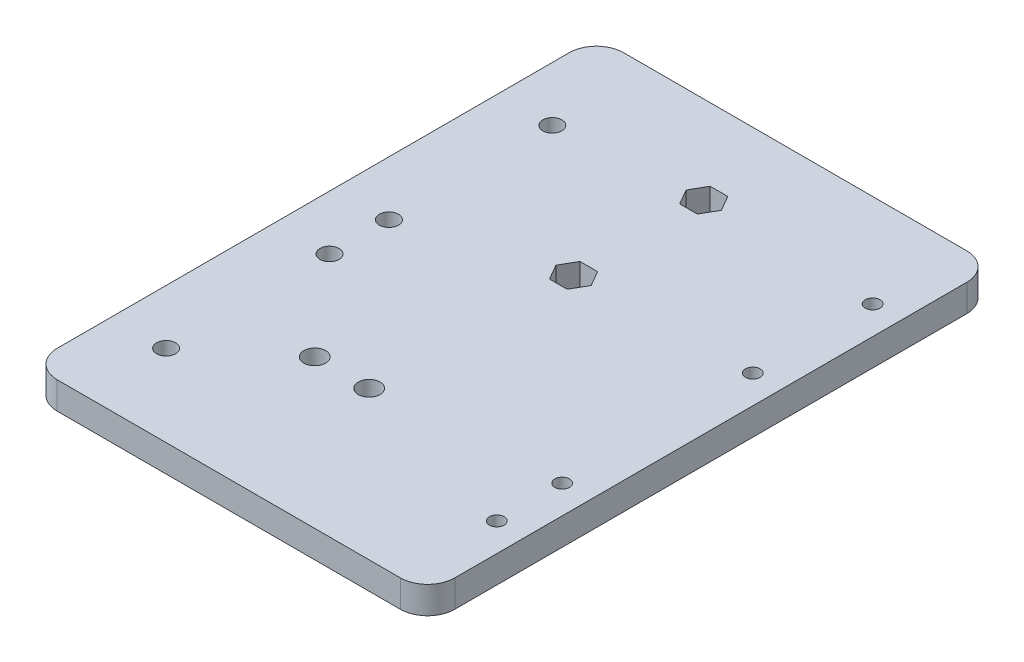
ISO-10303-21;
HEADER;
FILE_DESCRIPTION(('STEP AP214'),'2;1');
FILE_NAME('part.step','',(''),(''),'','','');
FILE_SCHEMA(('AUTOMOTIVE_DESIGN { 1 0 10303 214 1 1 1 1 }'));
ENDSEC;
DATA;
#1=APPLICATION_CONTEXT('core data for automotive mechanical design processes');
#2=APPLICATION_PROTOCOL_DEFINITION('international standard','automotive_design',2000,#1);
#3=PRODUCT_CONTEXT('',#1,'mechanical');
#4=PRODUCT('Part','Part','',(#3));
#5=PRODUCT_RELATED_PRODUCT_CATEGORY('part','',(#4));
#6=PRODUCT_DEFINITION_FORMATION('','',#4);
#7=PRODUCT_DEFINITION_CONTEXT('part definition',#1,'design');
#8=PRODUCT_DEFINITION('design','',#6,#7);
#9=PRODUCT_DEFINITION_SHAPE('','',#8);
#10=(LENGTH_UNIT() NAMED_UNIT(*) SI_UNIT(.MILLI.,.METRE.));
#11=(NAMED_UNIT(*) PLANE_ANGLE_UNIT() SI_UNIT($,.RADIAN.));
#12=(NAMED_UNIT(*) SI_UNIT($,.STERADIAN.) SOLID_ANGLE_UNIT());
#13=UNCERTAINTY_MEASURE_WITH_UNIT(LENGTH_MEASURE(1.E-05),#10,'distance_accuracy_value','');
#14=(GEOMETRIC_REPRESENTATION_CONTEXT(3) GLOBAL_UNCERTAINTY_ASSIGNED_CONTEXT((#13)) GLOBAL_UNIT_ASSIGNED_CONTEXT((#10,
#11,#12)) REPRESENTATION_CONTEXT('',''));
#15=CARTESIAN_POINT('',(0.,0.,0.));
#16=DIRECTION('',(0.,0.,1.));
#17=DIRECTION('',(1.,0.,0.));
#18=AXIS2_PLACEMENT_3D('',#15,#16,#17);
#19=CARTESIAN_POINT('',(-157.389030179501,188.784554556095,-475.424398782479));
#20=DIRECTION('',(0.,0.,-1.));
#21=DIRECTION('',(-1.,0.,0.));
#22=AXIS2_PLACEMENT_3D('',#19,#20,#21);
#23=PLANE('',#22);
#24=DIRECTION('',(1.,0.,0.));
#25=VECTOR('',#24,1.);
#26=CARTESIAN_POINT('',(-157.389030179501,188.784554556095,-475.424398782479));
#27=LINE('',#26,#25);
#28=CARTESIAN_POINT('',(-150.389030179501,188.784554556095,-475.424398782479));
#29=VERTEX_POINT('',#28);
#30=CARTESIAN_POINT('',(-87.3890301795011,188.784554556095,-475.424398782479));
#31=VERTEX_POINT('',#30);
#32=EDGE_CURVE('E302',#29,#31,#27,.T.);
#33=ORIENTED_EDGE('',*,*,#32,.F.);
#34=DIRECTION('',(0.,-1.,0.));
#35=VECTOR('',#34,1.);
#36=CARTESIAN_POINT('',(-150.389030179501,188.784554556095,-475.424398782479));
#37=LINE('',#36,#35);
#38=CARTESIAN_POINT('',(-150.389030179501,183.784554556095,-475.424398782479));
#39=VERTEX_POINT('',#38);
#40=EDGE_CURVE('E11',#29,#39,#37,.T.);
#41=ORIENTED_EDGE('',*,*,#40,.T.);
#42=DIRECTION('',(1.,0.,0.));
#43=VECTOR('',#42,1.);
#44=CARTESIAN_POINT('',(-157.389030179501,183.784554556095,-475.424398782479));
#45=LINE('',#44,#43);
#46=CARTESIAN_POINT('',(-87.3890301795011,183.784554556095,-475.424398782479));
#47=VERTEX_POINT('',#46);
#48=EDGE_CURVE('E281',#39,#47,#45,.T.);
#49=ORIENTED_EDGE('',*,*,#48,.T.);
#50=DIRECTION('',(0.,-1.,0.));
#51=VECTOR('',#50,1.);
#52=CARTESIAN_POINT('',(-87.3890301795011,188.784554556095,-475.424398782479));
#53=LINE('',#52,#51);
#54=EDGE_CURVE('E45',#47,#31,#53,.F.);
#55=ORIENTED_EDGE('',*,*,#54,.T.);
#56=EDGE_LOOP('',(#33,#41,#49,#55));
#57=FACE_BOUND('',#56,.T.);
#58=ADVANCED_FACE('F37',(#57),#23,.F.);
#59=CARTESIAN_POINT('',(-82.3890301795011,188.784554556095,-475.424398782479));
#60=DIRECTION('',(-1.,0.,0.));
#61=DIRECTION('',(0.,0.,1.));
#62=AXIS2_PLACEMENT_3D('',#59,#60,#61);
#63=PLANE('',#62);
#64=DIRECTION('',(0.,0.,-1.));
#65=VECTOR('',#64,1.);
#66=CARTESIAN_POINT('',(-82.3890301795011,183.784554556095,-475.424398782479));
#67=LINE('',#66,#65);
#68=CARTESIAN_POINT('',(-82.3890301795011,183.784554556095,-480.424398782479));
#69=VERTEX_POINT('',#68);
#70=CARTESIAN_POINT('',(-82.3890301795011,183.784554556095,-574.424398782479));
#71=VERTEX_POINT('',#70);
#72=EDGE_CURVE('E313',#69,#71,#67,.T.);
#73=ORIENTED_EDGE('',*,*,#72,.T.);
#74=DIRECTION('',(0.,-1.,0.));
#75=VECTOR('',#74,1.);
#76=CARTESIAN_POINT('',(-82.3890301795011,188.784554556095,-574.424398782479));
#77=LINE('',#76,#75);
#78=CARTESIAN_POINT('',(-82.3890301795011,188.784554556095,-574.424398782479));
#79=VERTEX_POINT('',#78);
#80=EDGE_CURVE('E333',#71,#79,#77,.F.);
#81=ORIENTED_EDGE('',*,*,#80,.T.);
#82=DIRECTION('',(0.,0.,-1.));
#83=VECTOR('',#82,1.);
#84=CARTESIAN_POINT('',(-82.3890301795011,188.784554556095,-475.424398782479));
#85=LINE('',#84,#83);
#86=CARTESIAN_POINT('',(-82.3890301795011,188.784554556095,-480.424398782479));
#87=VERTEX_POINT('',#86);
#88=EDGE_CURVE('E304',#87,#79,#85,.T.);
#89=ORIENTED_EDGE('',*,*,#88,.F.);
#90=DIRECTION('',(0.,-1.,0.));
#91=VECTOR('',#90,1.);
#92=CARTESIAN_POINT('',(-82.3890301795011,188.784554556095,-480.424398782479));
#93=LINE('',#92,#91);
#94=EDGE_CURVE('E330',#87,#69,#93,.T.);
#95=ORIENTED_EDGE('',*,*,#94,.T.);
#96=EDGE_LOOP('',(#73,#81,#89,#95));
#97=FACE_BOUND('',#96,.T.);
#98=ADVANCED_FACE('F430',(#97),#63,.F.);
#99=CARTESIAN_POINT('',(-157.389030179501,188.784554556095,-579.424398782479));
#100=DIRECTION('',(0.,0.,1.));
#101=DIRECTION('',(1.,0.,0.));
#102=AXIS2_PLACEMENT_3D('',#99,#100,#101);
#103=PLANE('',#102);
#104=DIRECTION('',(-1.,0.,0.));
#105=VECTOR('',#104,1.);
#106=CARTESIAN_POINT('',(-157.389030179501,188.784554556095,-579.424398782479));
#107=LINE('',#106,#105);
#108=CARTESIAN_POINT('',(-87.3890301795011,188.784554556095,-579.424398782479));
#109=VERTEX_POINT('',#108);
#110=CARTESIAN_POINT('',(-150.389030179501,188.784554556095,-579.424398782479));
#111=VERTEX_POINT('',#110);
#112=EDGE_CURVE('E308',#109,#111,#107,.T.);
#113=ORIENTED_EDGE('',*,*,#112,.F.);
#114=DIRECTION('',(0.,-1.,0.));
#115=VECTOR('',#114,1.);
#116=CARTESIAN_POINT('',(-87.3890301795011,188.784554556095,-579.424398782479));
#117=LINE('',#116,#115);
#118=CARTESIAN_POINT('',(-87.3890301795011,183.784554556095,-579.424398782479));
#119=VERTEX_POINT('',#118);
#120=EDGE_CURVE('E319',#109,#119,#117,.T.);
#121=ORIENTED_EDGE('',*,*,#120,.T.);
#122=DIRECTION('',(-1.,0.,0.));
#123=VECTOR('',#122,1.);
#124=CARTESIAN_POINT('',(-157.389030179501,183.784554556095,-579.424398782479));
#125=LINE('',#124,#123);
#126=CARTESIAN_POINT('',(-150.389030179501,183.784554556095,-579.424398782479));
#127=VERTEX_POINT('',#126);
#128=EDGE_CURVE('E305',#119,#127,#125,.T.);
#129=ORIENTED_EDGE('',*,*,#128,.T.);
#130=DIRECTION('',(0.,-1.,0.));
#131=VECTOR('',#130,1.);
#132=CARTESIAN_POINT('',(-150.389030179501,188.784554556095,-579.424398782479));
#133=LINE('',#132,#131);
#134=EDGE_CURVE('E311',#127,#111,#133,.F.);
#135=ORIENTED_EDGE('',*,*,#134,.T.);
#136=EDGE_LOOP('',(#113,#121,#129,#135));
#137=FACE_BOUND('',#136,.T.);
#138=ADVANCED_FACE('F435',(#137),#103,.F.);
#139=CARTESIAN_POINT('',(0.,188.784554556095,0.));
#140=DIRECTION('',(0.,-1.,0.));
#141=DIRECTION('',(0.,0.,-1.));
#142=AXIS2_PLACEMENT_3D('',#139,#140,#141);
#143=PLANE('',#142);
#144=CARTESIAN_POINT('',(-87.5890301795012,188.784554556095,-540.330584131833));
#145=DIRECTION('',(0.,-1.,0.));
#146=DIRECTION('',(0.,0.,-1.));
#147=AXIS2_PLACEMENT_3D('',#144,#145,#146);
#148=CIRCLE('',#147,1.35);
#149=CARTESIAN_POINT('',(-87.5890301795012,188.784554556095,-541.680584131833));
#150=VERTEX_POINT('',#149);
#151=EDGE_CURVE('E374',#150,#150,#148,.T.);
#152=ORIENTED_EDGE('',*,*,#151,.T.);
#153=EDGE_LOOP('',(#152));
#154=FACE_BOUND('',#153,.T.);
#155=CARTESIAN_POINT('',(-87.5890301795136,188.784554556095,-505.330584131833));
#156=DIRECTION('',(0.,-1.,0.));
#157=DIRECTION('',(0.,0.,-1.));
#158=AXIS2_PLACEMENT_3D('',#155,#156,#157);
#159=CIRCLE('',#158,1.35000000000145);
#160=CARTESIAN_POINT('',(-87.5890301795136,188.784554556095,-506.680584131835));
#161=VERTEX_POINT('',#160);
#162=EDGE_CURVE('E385',#161,#161,#159,.T.);
#163=ORIENTED_EDGE('',*,*,#162,.T.);
#164=EDGE_LOOP('',(#163));
#165=FACE_BOUND('',#164,.T.);
#166=CARTESIAN_POINT('',(-87.5890301795179,188.784554556095,-493.330584131833));
#167=DIRECTION('',(0.,-1.,0.));
#168=DIRECTION('',(0.,0.,-1.));
#169=AXIS2_PLACEMENT_3D('',#166,#167,#168);
#170=CIRCLE('',#169,1.35000000000146);
#171=CARTESIAN_POINT('',(-87.5890301795179,188.784554556095,-494.680584131835));
#172=VERTEX_POINT('',#171);
#173=EDGE_CURVE('E228',#172,#172,#170,.T.);
#174=ORIENTED_EDGE('',*,*,#173,.T.);
#175=EDGE_LOOP('',(#174));
#176=FACE_BOUND('',#175,.T.);
#177=DIRECTION('',(0.500000000000009,0.,0.866025403784433));
#178=VECTOR('',#177,1.);
#179=CARTESIAN_POINT('',(-116.35270716458,188.784554556095,-539.423221971983));
#180=LINE('',#179,#178);
#181=CARTESIAN_POINT('',(-117.969287918311,188.784554556095,-542.223221971982));
#182=VERTEX_POINT('',#181);
#183=CARTESIAN_POINT('',(-116.35270716458,188.784554556095,-539.423221971983));
#184=VERTEX_POINT('',#183);
#185=EDGE_CURVE('E210',#182,#184,#180,.T.);
#186=ORIENTED_EDGE('',*,*,#185,.T.);
#187=DIRECTION('',(-0.499999999999996,0.,0.866025403784441));
#188=VECTOR('',#187,1.);
#189=CARTESIAN_POINT('',(-117.969287918311,188.784554556095,-536.623221971985));
#190=LINE('',#189,#188);
#191=CARTESIAN_POINT('',(-117.969287918311,188.784554556095,-536.623221971985));
#192=VERTEX_POINT('',#191);
#193=EDGE_CURVE('E181',#184,#192,#190,.T.);
#194=ORIENTED_EDGE('',*,*,#193,.T.);
#195=DIRECTION('',(-1.,0.,0.));
#196=VECTOR('',#195,1.);
#197=CARTESIAN_POINT('',(-121.202449425771,188.784554556095,-536.623221971985));
#198=LINE('',#197,#196);
#199=CARTESIAN_POINT('',(-121.202449425771,188.784554556095,-536.623221971985));
#200=VERTEX_POINT('',#199);
#201=EDGE_CURVE('E222',#192,#200,#198,.T.);
#202=ORIENTED_EDGE('',*,*,#201,.T.);
#203=DIRECTION('',(-0.499999999999996,0.,-0.866025403784441));
#204=VECTOR('',#203,1.);
#205=CARTESIAN_POINT('',(-122.819030179501,188.784554556095,-539.423221971983));
#206=LINE('',#205,#204);
#207=CARTESIAN_POINT('',(-122.819030179501,188.784554556095,-539.423221971983));
#208=VERTEX_POINT('',#207);
#209=EDGE_CURVE('E219',#200,#208,#206,.T.);
#210=ORIENTED_EDGE('',*,*,#209,.T.);
#211=DIRECTION('',(0.499999999999996,0.,-0.866025403784441));
#212=VECTOR('',#211,1.);
#213=CARTESIAN_POINT('',(-121.202449425771,188.784554556095,-542.223221971982));
#214=LINE('',#213,#212);
#215=CARTESIAN_POINT('',(-121.202449425771,188.784554556095,-542.223221971982));
#216=VERTEX_POINT('',#215);
#217=EDGE_CURVE('E216',#208,#216,#214,.T.);
#218=ORIENTED_EDGE('',*,*,#217,.T.);
#219=DIRECTION('',(1.,0.,0.));
#220=VECTOR('',#219,1.);
#221=CARTESIAN_POINT('',(-117.969287918311,188.784554556095,-542.223221971982));
#222=LINE('',#221,#220);
#223=EDGE_CURVE('E212',#216,#182,#222,.T.);
#224=ORIENTED_EDGE('',*,*,#223,.T.);
#225=EDGE_LOOP('',(#186,#194,#202,#210,#218,#224));
#226=FACE_BOUND('',#225,.T.);
#227=CARTESIAN_POINT('',(-120.389030179501,188.784554556095,-502.700786837157));
#228=DIRECTION('',(0.,-1.,0.));
#229=DIRECTION('',(0.,0.,-1.));
#230=AXIS2_PLACEMENT_3D('',#227,#228,#229);
#231=CIRCLE('',#230,2.00000000000001);
#232=CARTESIAN_POINT('',(-120.389030179501,188.784554556095,-504.700786837157));
#233=VERTEX_POINT('',#232);
#234=EDGE_CURVE('E362',#233,#233,#231,.T.);
#235=ORIENTED_EDGE('',*,*,#234,.T.);
#236=EDGE_LOOP('',(#235));
#237=FACE_BOUND('',#236,.T.);
#238=CARTESIAN_POINT('',(-130.389030179501,188.784554556095,-502.700786837157));
#239=DIRECTION('',(0.,-1.,0.));
#240=DIRECTION('',(0.,0.,-1.));
#241=AXIS2_PLACEMENT_3D('',#238,#239,#240);
#242=CIRCLE('',#241,2.00000000000002);
#243=CARTESIAN_POINT('',(-130.389030179501,188.784554556095,-504.700786837157));
#244=VERTEX_POINT('',#243);
#245=EDGE_CURVE('E368',#244,#244,#242,.T.);
#246=ORIENTED_EDGE('',*,*,#245,.T.);
#247=EDGE_LOOP('',(#246));
#248=FACE_BOUND('',#247,.T.);
#249=CARTESIAN_POINT('',(-87.5890301794934,188.784554556095,-562.330584131833));
#250=DIRECTION('',(0.,-1.,0.));
#251=DIRECTION('',(0.,0.,-1.));
#252=AXIS2_PLACEMENT_3D('',#249,#250,#251);
#253=CIRCLE('',#252,1.34999999999998);
#254=CARTESIAN_POINT('',(-87.5890301794934,188.784554556095,-563.680584131833));
#255=VERTEX_POINT('',#254);
#256=EDGE_CURVE('E375',#255,#255,#253,.T.);
#257=ORIENTED_EDGE('',*,*,#256,.T.);
#258=EDGE_LOOP('',(#257));
#259=FACE_BOUND('',#258,.T.);
#260=DIRECTION('',(0.50000000000009,0.,0.866025403784387));
#261=VECTOR('',#260,1.);
#262=CARTESIAN_POINT('',(-116.355868672035,188.784554556095,-563.330584131844));
#263=LINE('',#262,#261);
#264=CARTESIAN_POINT('',(-117.972449425765,188.784554556095,-566.130584131842));
#265=VERTEX_POINT('',#264);
#266=CARTESIAN_POINT('',(-116.355868672035,188.784554556095,-563.330584131844));
#267=VERTEX_POINT('',#266);
#268=EDGE_CURVE('E248',#265,#267,#263,.T.);
#269=ORIENTED_EDGE('',*,*,#268,.T.);
#270=DIRECTION('',(-0.499999999999783,0.,0.866025403784564));
#271=VECTOR('',#270,1.);
#272=CARTESIAN_POINT('',(-117.972449425764,188.784554556095,-560.530584131847));
#273=LINE('',#272,#271);
#274=CARTESIAN_POINT('',(-117.972449425764,188.784554556095,-560.530584131847));
#275=VERTEX_POINT('',#274);
#276=EDGE_CURVE('E232',#267,#275,#273,.T.);
#277=ORIENTED_EDGE('',*,*,#276,.T.);
#278=DIRECTION('',(-1.,0.,0.));
#279=VECTOR('',#278,1.);
#280=CARTESIAN_POINT('',(-121.205610933224,188.784554556095,-560.530584131847));
#281=LINE('',#280,#279);
#282=CARTESIAN_POINT('',(-121.205610933224,188.784554556095,-560.530584131847));
#283=VERTEX_POINT('',#282);
#284=EDGE_CURVE('E235',#275,#283,#281,.T.);
#285=ORIENTED_EDGE('',*,*,#284,.T.);
#286=DIRECTION('',(-0.499999999999761,0.,-0.866025403784577));
#287=VECTOR('',#286,1.);
#288=CARTESIAN_POINT('',(-122.822191686953,188.784554556095,-563.330584131846));
#289=LINE('',#288,#287);
#290=CARTESIAN_POINT('',(-122.822191686953,188.784554556095,-563.330584131846));
#291=VERTEX_POINT('',#290);
#292=EDGE_CURVE('E239',#283,#291,#289,.T.);
#293=ORIENTED_EDGE('',*,*,#292,.T.);
#294=DIRECTION('',(0.499999999999815,0.,-0.866025403784546));
#295=VECTOR('',#294,1.);
#296=CARTESIAN_POINT('',(-121.205610933225,188.784554556095,-566.130584131842));
#297=LINE('',#296,#295);
#298=CARTESIAN_POINT('',(-121.205610933225,188.784554556095,-566.130584131842));
#299=VERTEX_POINT('',#298);
#300=EDGE_CURVE('E242',#291,#299,#297,.T.);
#301=ORIENTED_EDGE('',*,*,#300,.T.);
#302=DIRECTION('',(1.,0.,0.));
#303=VECTOR('',#302,1.);
#304=CARTESIAN_POINT('',(-117.972449425765,188.784554556095,-566.130584131842));
#305=LINE('',#304,#303);
#306=EDGE_CURVE('E245',#299,#265,#305,.T.);
#307=ORIENTED_EDGE('',*,*,#306,.T.);
#308=EDGE_LOOP('',(#269,#277,#285,#293,#301,#307));
#309=FACE_BOUND('',#308,.T.);
#310=CARTESIAN_POINT('',(-145.389030179501,188.784554556095,-490.424398782479));
#311=DIRECTION('',(0.,1.,0.));
#312=DIRECTION('',(0.,0.,1.));
#313=AXIS2_PLACEMENT_3D('',#310,#311,#312);
#314=CIRCLE('',#313,1.75000000000001);
#315=CARTESIAN_POINT('',(-145.389030179501,188.784554556095,-488.674398782479));
#316=VERTEX_POINT('',#315);
#317=EDGE_CURVE('E282',#316,#316,#314,.T.);
#318=ORIENTED_EDGE('',*,*,#317,.F.);
#319=EDGE_LOOP('',(#318));
#320=FACE_BOUND('',#319,.T.);
#321=CARTESIAN_POINT('',(-145.389030179501,188.784554556095,-520.424398782479));
#322=DIRECTION('',(0.,1.,0.));
#323=DIRECTION('',(0.,0.,1.));
#324=AXIS2_PLACEMENT_3D('',#321,#322,#323);
#325=CIRCLE('',#324,1.74999999999999);
#326=CARTESIAN_POINT('',(-145.389030179501,188.784554556095,-518.674398782479));
#327=VERTEX_POINT('',#326);
#328=EDGE_CURVE('E285',#327,#327,#325,.T.);
#329=ORIENTED_EDGE('',*,*,#328,.F.);
#330=EDGE_LOOP('',(#329));
#331=FACE_BOUND('',#330,.T.);
#332=CARTESIAN_POINT('',(-145.389030179501,188.784554556095,-531.324398782479));
#333=DIRECTION('',(0.,1.,0.));
#334=DIRECTION('',(0.,0.,1.));
#335=AXIS2_PLACEMENT_3D('',#332,#333,#334);
#336=CIRCLE('',#335,1.74999999999999);
#337=CARTESIAN_POINT('',(-145.389030179501,188.784554556095,-529.574398782479));
#338=VERTEX_POINT('',#337);
#339=EDGE_CURVE('E291',#338,#338,#336,.T.);
#340=ORIENTED_EDGE('',*,*,#339,.F.);
#341=EDGE_LOOP('',(#340));
#342=FACE_BOUND('',#341,.T.);
#343=CARTESIAN_POINT('',(-145.389030179501,188.784554556095,-561.324398782479));
#344=DIRECTION('',(0.,1.,0.));
#345=DIRECTION('',(0.,0.,1.));
#346=AXIS2_PLACEMENT_3D('',#343,#344,#345);
#347=CIRCLE('',#346,1.74999999999999);
#348=CARTESIAN_POINT('',(-145.389030179501,188.784554556095,-559.574398782479));
#349=VERTEX_POINT('',#348);
#350=EDGE_CURVE('E297',#349,#349,#347,.T.);
#351=ORIENTED_EDGE('',*,*,#350,.F.);
#352=EDGE_LOOP('',(#351));
#353=FACE_BOUND('',#352,.T.);
#354=ORIENTED_EDGE('',*,*,#88,.T.);
#355=CARTESIAN_POINT('',(-87.3890301795011,188.784554556095,-574.424398782479));
#356=DIRECTION('',(0.,-1.,0.));
#357=DIRECTION('',(0.,0.,-1.));
#358=AXIS2_PLACEMENT_3D('',#355,#356,#357);
#359=CIRCLE('',#358,5.);
#360=EDGE_CURVE('E340',#79,#109,#359,.F.);
#361=ORIENTED_EDGE('',*,*,#360,.T.);
#362=ORIENTED_EDGE('',*,*,#112,.T.);
#363=CARTESIAN_POINT('',(-150.389030179501,188.784554556095,-574.424398782479));
#364=DIRECTION('',(0.,-1.,0.));
#365=DIRECTION('',(0.,0.,-1.));
#366=AXIS2_PLACEMENT_3D('',#363,#364,#365);
#367=CIRCLE('',#366,5.);
#368=CARTESIAN_POINT('',(-155.389030179501,188.784554556095,-574.424398782479));
#369=VERTEX_POINT('',#368);
#370=EDGE_CURVE('E338',#111,#369,#367,.F.);
#371=ORIENTED_EDGE('',*,*,#370,.T.);
#372=DIRECTION('',(0.,0.,1.));
#373=VECTOR('',#372,1.);
#374=CARTESIAN_POINT('',(-155.389030179501,188.784554556095,-475.424398782479));
#375=LINE('',#374,#373);
#376=CARTESIAN_POINT('',(-155.389030179501,188.784554556095,-480.424398782479));
#377=VERTEX_POINT('',#376);
#378=EDGE_CURVE('E354',#369,#377,#375,.T.);
#379=ORIENTED_EDGE('',*,*,#378,.T.);
#380=CARTESIAN_POINT('',(-150.389030179501,188.784554556095,-480.424398782479));
#381=DIRECTION('',(0.,-1.,0.));
#382=DIRECTION('',(0.,0.,-1.));
#383=AXIS2_PLACEMENT_3D('',#380,#381,#382);
#384=CIRCLE('',#383,5.);
#385=EDGE_CURVE('E58',#377,#29,#384,.F.);
#386=ORIENTED_EDGE('',*,*,#385,.T.);
#387=ORIENTED_EDGE('',*,*,#32,.T.);
#388=CARTESIAN_POINT('',(-87.3890301795011,188.784554556095,-480.424398782479));
#389=DIRECTION('',(0.,-1.,0.));
#390=DIRECTION('',(0.,0.,-1.));
#391=AXIS2_PLACEMENT_3D('',#388,#389,#390);
#392=CIRCLE('',#391,5.);
#393=EDGE_CURVE('E335',#31,#87,#392,.F.);
#394=ORIENTED_EDGE('',*,*,#393,.T.);
#395=EDGE_LOOP('',(#354,#361,#362,#371,#379,#386,#387,#394));
#396=FACE_BOUND('',#395,.T.);
#397=ADVANCED_FACE('F414',(#154,#165,#176,#226,#237,#248,#259,#309,#320,#331,#342,#353,#396),
#143,.F.);
#398=CARTESIAN_POINT('',(0.,183.784554556095,0.));
#399=DIRECTION('',(0.,-1.,0.));
#400=DIRECTION('',(0.,0.,-1.));
#401=AXIS2_PLACEMENT_3D('',#398,#399,#400);
#402=PLANE('',#401);
#403=ORIENTED_EDGE('',*,*,#128,.F.);
#404=CARTESIAN_POINT('',(-87.3890301795011,183.784554556095,-574.424398782479));
#405=DIRECTION('',(0.,-1.,0.));
#406=DIRECTION('',(0.,0.,-1.));
#407=AXIS2_PLACEMENT_3D('',#404,#405,#406);
#408=CIRCLE('',#407,5.);
#409=EDGE_CURVE('E328',#119,#71,#408,.T.);
#410=ORIENTED_EDGE('',*,*,#409,.T.);
#411=ORIENTED_EDGE('',*,*,#72,.F.);
#412=CARTESIAN_POINT('',(-87.3890301795011,183.784554556095,-480.424398782479));
#413=DIRECTION('',(0.,-1.,0.));
#414=DIRECTION('',(0.,0.,-1.));
#415=AXIS2_PLACEMENT_3D('',#412,#413,#414);
#416=CIRCLE('',#415,5.);
#417=EDGE_CURVE('E322',#69,#47,#416,.T.);
#418=ORIENTED_EDGE('',*,*,#417,.T.);
#419=ORIENTED_EDGE('',*,*,#48,.F.);
#420=CARTESIAN_POINT('',(-150.389030179501,183.784554556095,-480.424398782479));
#421=DIRECTION('',(0.,-1.,0.));
#422=DIRECTION('',(0.,0.,-1.));
#423=AXIS2_PLACEMENT_3D('',#420,#421,#422);
#424=CIRCLE('',#423,5.);
#425=CARTESIAN_POINT('',(-155.389030179501,183.784554556095,-480.424398782479));
#426=VERTEX_POINT('',#425);
#427=EDGE_CURVE('E324',#39,#426,#424,.T.);
#428=ORIENTED_EDGE('',*,*,#427,.T.);
#429=DIRECTION('',(0.,0.,1.));
#430=VECTOR('',#429,1.);
#431=CARTESIAN_POINT('',(-155.389030179501,183.784554556095,-475.424398782479));
#432=LINE('',#431,#430);
#433=CARTESIAN_POINT('',(-155.389030179501,183.784554556095,-574.424398782479));
#434=VERTEX_POINT('',#433);
#435=EDGE_CURVE('E352',#434,#426,#432,.T.);
#436=ORIENTED_EDGE('',*,*,#435,.F.);
#437=CARTESIAN_POINT('',(-150.389030179501,183.784554556095,-574.424398782479));
#438=DIRECTION('',(0.,-1.,0.));
#439=DIRECTION('',(0.,0.,-1.));
#440=AXIS2_PLACEMENT_3D('',#437,#438,#439);
#441=CIRCLE('',#440,5.);
#442=EDGE_CURVE('E326',#434,#127,#441,.T.);
#443=ORIENTED_EDGE('',*,*,#442,.T.);
#444=EDGE_LOOP('',(#403,#410,#411,#418,#419,#428,#436,#443));
#445=FACE_BOUND('',#444,.T.);
#446=CARTESIAN_POINT('',(-87.5890301795012,183.784554556095,-540.330584131833));
#447=DIRECTION('',(0.,-1.,0.));
#448=DIRECTION('',(0.,0.,-1.));
#449=AXIS2_PLACEMENT_3D('',#446,#447,#448);
#450=CIRCLE('',#449,1.35);
#451=CARTESIAN_POINT('',(-87.5890301795012,183.784554556095,-541.680584131833));
#452=VERTEX_POINT('',#451);
#453=EDGE_CURVE('E388',#452,#452,#450,.T.);
#454=ORIENTED_EDGE('',*,*,#453,.F.);
#455=EDGE_LOOP('',(#454));
#456=FACE_BOUND('',#455,.T.);
#457=CARTESIAN_POINT('',(-87.5890301795136,183.784554556095,-505.330584131833));
#458=DIRECTION('',(0.,-1.,0.));
#459=DIRECTION('',(0.,0.,-1.));
#460=AXIS2_PLACEMENT_3D('',#457,#458,#459);
#461=CIRCLE('',#460,1.35000000000145);
#462=CARTESIAN_POINT('',(-87.5890301795136,183.784554556095,-506.680584131835));
#463=VERTEX_POINT('',#462);
#464=EDGE_CURVE('E231',#463,#463,#461,.T.);
#465=ORIENTED_EDGE('',*,*,#464,.F.);
#466=EDGE_LOOP('',(#465));
#467=FACE_BOUND('',#466,.T.);
#468=CARTESIAN_POINT('',(-87.5890301795179,183.784554556095,-493.330584131833));
#469=DIRECTION('',(0.,-1.,0.));
#470=DIRECTION('',(0.,0.,-1.));
#471=AXIS2_PLACEMENT_3D('',#468,#469,#470);
#472=CIRCLE('',#471,1.35000000000146);
#473=CARTESIAN_POINT('',(-87.5890301795179,183.784554556095,-494.680584131835));
#474=VERTEX_POINT('',#473);
#475=EDGE_CURVE('E186',#474,#474,#472,.T.);
#476=ORIENTED_EDGE('',*,*,#475,.F.);
#477=EDGE_LOOP('',(#476));
#478=FACE_BOUND('',#477,.T.);
#479=DIRECTION('',(-0.499999999999996,0.,0.866025403784441));
#480=VECTOR('',#479,1.);
#481=CARTESIAN_POINT('',(-117.969287918311,183.784554556095,-536.623221971985));
#482=LINE('',#481,#480);
#483=CARTESIAN_POINT('',(-116.35270716458,183.784554556095,-539.423221971983));
#484=VERTEX_POINT('',#483);
#485=CARTESIAN_POINT('',(-117.969287918311,183.784554556095,-536.623221971985));
#486=VERTEX_POINT('',#485);
#487=EDGE_CURVE('E178',#484,#486,#482,.T.);
#488=ORIENTED_EDGE('',*,*,#487,.F.);
#489=DIRECTION('',(0.500000000000009,0.,0.866025403784433));
#490=VECTOR('',#489,1.);
#491=CARTESIAN_POINT('',(-116.35270716458,183.784554556095,-539.423221971983));
#492=LINE('',#491,#490);
#493=CARTESIAN_POINT('',(-117.969287918311,183.784554556095,-542.223221971982));
#494=VERTEX_POINT('',#493);
#495=EDGE_CURVE('E189',#494,#484,#492,.T.);
#496=ORIENTED_EDGE('',*,*,#495,.F.);
#497=DIRECTION('',(1.,0.,0.));
#498=VECTOR('',#497,1.);
#499=CARTESIAN_POINT('',(-117.969287918311,183.784554556095,-542.223221971982));
#500=LINE('',#499,#498);
#501=CARTESIAN_POINT('',(-121.202449425771,183.784554556095,-542.223221971982));
#502=VERTEX_POINT('',#501);
#503=EDGE_CURVE('E194',#502,#494,#500,.T.);
#504=ORIENTED_EDGE('',*,*,#503,.F.);
#505=DIRECTION('',(0.499999999999996,0.,-0.866025403784441));
#506=VECTOR('',#505,1.);
#507=CARTESIAN_POINT('',(-121.202449425771,183.784554556095,-542.223221971982));
#508=LINE('',#507,#506);
#509=CARTESIAN_POINT('',(-122.819030179501,183.784554556095,-539.423221971983));
#510=VERTEX_POINT('',#509);
#511=EDGE_CURVE('E402',#510,#502,#508,.T.);
#512=ORIENTED_EDGE('',*,*,#511,.F.);
#513=DIRECTION('',(-0.499999999999996,0.,-0.866025403784441));
#514=VECTOR('',#513,1.);
#515=CARTESIAN_POINT('',(-122.819030179501,183.784554556095,-539.423221971983));
#516=LINE('',#515,#514);
#517=CARTESIAN_POINT('',(-121.202449425771,183.784554556095,-536.623221971985));
#518=VERTEX_POINT('',#517);
#519=EDGE_CURVE('E206',#518,#510,#516,.T.);
#520=ORIENTED_EDGE('',*,*,#519,.F.);
#521=DIRECTION('',(-1.,0.,0.));
#522=VECTOR('',#521,1.);
#523=CARTESIAN_POINT('',(-121.202449425771,183.784554556095,-536.623221971985));
#524=LINE('',#523,#522);
#525=EDGE_CURVE('E201',#486,#518,#524,.T.);
#526=ORIENTED_EDGE('',*,*,#525,.F.);
#527=EDGE_LOOP('',(#488,#496,#504,#512,#520,#526));
#528=FACE_BOUND('',#527,.T.);
#529=CARTESIAN_POINT('',(-120.389030179501,183.784554556095,-502.700786837157));
#530=DIRECTION('',(0.,-1.,0.));
#531=DIRECTION('',(0.,0.,-1.));
#532=AXIS2_PLACEMENT_3D('',#529,#530,#531);
#533=CIRCLE('',#532,2.00000000000001);
#534=CARTESIAN_POINT('',(-120.389030179501,183.784554556095,-504.700786837157));
#535=VERTEX_POINT('',#534);
#536=EDGE_CURVE('E365',#535,#535,#533,.T.);
#537=ORIENTED_EDGE('',*,*,#536,.F.);
#538=EDGE_LOOP('',(#537));
#539=FACE_BOUND('',#538,.T.);
#540=CARTESIAN_POINT('',(-130.389030179501,183.784554556095,-502.700786837157));
#541=DIRECTION('',(0.,-1.,0.));
#542=DIRECTION('',(0.,0.,-1.));
#543=AXIS2_PLACEMENT_3D('',#540,#541,#542);
#544=CIRCLE('',#543,2.00000000000002);
#545=CARTESIAN_POINT('',(-130.389030179501,183.784554556095,-504.700786837157));
#546=VERTEX_POINT('',#545);
#547=EDGE_CURVE('E378',#546,#546,#544,.T.);
#548=ORIENTED_EDGE('',*,*,#547,.F.);
#549=EDGE_LOOP('',(#548));
#550=FACE_BOUND('',#549,.T.);
#551=CARTESIAN_POINT('',(-87.5890301794934,183.784554556095,-562.330584131833));
#552=DIRECTION('',(0.,-1.,0.));
#553=DIRECTION('',(0.,0.,-1.));
#554=AXIS2_PLACEMENT_3D('',#551,#552,#553);
#555=CIRCLE('',#554,1.34999999999998);
#556=CARTESIAN_POINT('',(-87.5890301794934,183.784554556095,-563.680584131833));
#557=VERTEX_POINT('',#556);
#558=EDGE_CURVE('E371',#557,#557,#555,.T.);
#559=ORIENTED_EDGE('',*,*,#558,.F.);
#560=EDGE_LOOP('',(#559));
#561=FACE_BOUND('',#560,.T.);
#562=DIRECTION('',(-0.499999999999783,0.,0.866025403784564));
#563=VECTOR('',#562,1.);
#564=CARTESIAN_POINT('',(-117.972449425764,183.784554556095,-560.530584131847));
#565=LINE('',#564,#563);
#566=CARTESIAN_POINT('',(-116.355868672035,183.784554556095,-563.330584131844));
#567=VERTEX_POINT('',#566);
#568=CARTESIAN_POINT('',(-117.972449425764,183.784554556095,-560.530584131847));
#569=VERTEX_POINT('',#568);
#570=EDGE_CURVE('E202',#567,#569,#565,.T.);
#571=ORIENTED_EDGE('',*,*,#570,.F.);
#572=DIRECTION('',(0.50000000000009,0.,0.866025403784387));
#573=VECTOR('',#572,1.);
#574=CARTESIAN_POINT('',(-116.355868672035,183.784554556095,-563.330584131844));
#575=LINE('',#574,#573);
#576=CARTESIAN_POINT('',(-117.972449425765,183.784554556095,-566.130584131842));
#577=VERTEX_POINT('',#576);
#578=EDGE_CURVE('E236',#577,#567,#575,.T.);
#579=ORIENTED_EDGE('',*,*,#578,.F.);
#580=DIRECTION('',(1.,0.,0.));
#581=VECTOR('',#580,1.);
#582=CARTESIAN_POINT('',(-117.972449425765,183.784554556095,-566.130584131842));
#583=LINE('',#582,#581);
#584=CARTESIAN_POINT('',(-121.205610933225,183.784554556095,-566.130584131842));
#585=VERTEX_POINT('',#584);
#586=EDGE_CURVE('E260',#585,#577,#583,.T.);
#587=ORIENTED_EDGE('',*,*,#586,.F.);
#588=DIRECTION('',(0.499999999999815,0.,-0.866025403784546));
#589=VECTOR('',#588,1.);
#590=CARTESIAN_POINT('',(-121.205610933225,183.784554556095,-566.130584131842));
#591=LINE('',#590,#589);
#592=CARTESIAN_POINT('',(-122.822191686953,183.784554556095,-563.330584131846));
#593=VERTEX_POINT('',#592);
#594=EDGE_CURVE('E257',#593,#585,#591,.T.);
#595=ORIENTED_EDGE('',*,*,#594,.F.);
#596=DIRECTION('',(-0.499999999999761,0.,-0.866025403784577));
#597=VECTOR('',#596,1.);
#598=CARTESIAN_POINT('',(-122.822191686953,183.784554556095,-563.330584131846));
#599=LINE('',#598,#597);
#600=CARTESIAN_POINT('',(-121.205610933224,183.784554556095,-560.530584131847));
#601=VERTEX_POINT('',#600);
#602=EDGE_CURVE('E254',#601,#593,#599,.T.);
#603=ORIENTED_EDGE('',*,*,#602,.F.);
#604=DIRECTION('',(-1.,0.,0.));
#605=VECTOR('',#604,1.);
#606=CARTESIAN_POINT('',(-121.205610933224,183.784554556095,-560.530584131847));
#607=LINE('',#606,#605);
#608=EDGE_CURVE('E204',#569,#601,#607,.T.);
#609=ORIENTED_EDGE('',*,*,#608,.F.);
#610=EDGE_LOOP('',(#571,#579,#587,#595,#603,#609));
#611=FACE_BOUND('',#610,.T.);
#612=CARTESIAN_POINT('',(-145.389030179501,183.784554556095,-490.424398782479));
#613=DIRECTION('',(0.,1.,0.));
#614=DIRECTION('',(0.,0.,1.));
#615=AXIS2_PLACEMENT_3D('',#612,#613,#614);
#616=CIRCLE('',#615,1.75000000000001);
#617=CARTESIAN_POINT('',(-145.389030179501,183.784554556095,-488.674398782479));
#618=VERTEX_POINT('',#617);
#619=EDGE_CURVE('E278',#618,#618,#616,.T.);
#620=ORIENTED_EDGE('',*,*,#619,.T.);
#621=EDGE_LOOP('',(#620));
#622=FACE_BOUND('',#621,.T.);
#623=CARTESIAN_POINT('',(-145.389030179501,183.784554556095,-520.424398782479));
#624=DIRECTION('',(0.,1.,0.));
#625=DIRECTION('',(0.,0.,1.));
#626=AXIS2_PLACEMENT_3D('',#623,#624,#625);
#627=CIRCLE('',#626,1.74999999999999);
#628=CARTESIAN_POINT('',(-145.389030179501,183.784554556095,-518.674398782479));
#629=VERTEX_POINT('',#628);
#630=EDGE_CURVE('E288',#629,#629,#627,.T.);
#631=ORIENTED_EDGE('',*,*,#630,.T.);
#632=EDGE_LOOP('',(#631));
#633=FACE_BOUND('',#632,.T.);
#634=CARTESIAN_POINT('',(-145.389030179501,183.784554556095,-531.324398782479));
#635=DIRECTION('',(0.,1.,0.));
#636=DIRECTION('',(0.,0.,1.));
#637=AXIS2_PLACEMENT_3D('',#634,#635,#636);
#638=CIRCLE('',#637,1.74999999999999);
#639=CARTESIAN_POINT('',(-145.389030179501,183.784554556095,-529.574398782479));
#640=VERTEX_POINT('',#639);
#641=EDGE_CURVE('E294',#640,#640,#638,.T.);
#642=ORIENTED_EDGE('',*,*,#641,.T.);
#643=EDGE_LOOP('',(#642));
#644=FACE_BOUND('',#643,.T.);
#645=CARTESIAN_POINT('',(-145.389030179501,183.784554556095,-561.324398782479));
#646=DIRECTION('',(0.,1.,0.));
#647=DIRECTION('',(0.,0.,1.));
#648=AXIS2_PLACEMENT_3D('',#645,#646,#647);
#649=CIRCLE('',#648,1.74999999999999);
#650=CARTESIAN_POINT('',(-145.389030179501,183.784554556095,-559.574398782479));
#651=VERTEX_POINT('',#650);
#652=EDGE_CURVE('E267',#651,#651,#649,.T.);
#653=ORIENTED_EDGE('',*,*,#652,.T.);
#654=EDGE_LOOP('',(#653));
#655=FACE_BOUND('',#654,.T.);
#656=ADVANCED_FACE('F197',(#445,#456,#467,#478,#528,#539,#550,#561,#611,#622,#633,#644,#655),
#402,.T.);
#657=CARTESIAN_POINT('',(-145.389030179501,183.784554556095,-561.324398782479));
#658=DIRECTION('',(0.,1.,0.));
#659=DIRECTION('',(0.,0.,1.));
#660=AXIS2_PLACEMENT_3D('',#657,#658,#659);
#661=CYLINDRICAL_SURFACE('',#660,1.74999999999999);
#662=ORIENTED_EDGE('',*,*,#652,.F.);
#663=EDGE_LOOP('',(#662));
#664=FACE_BOUND('',#663,.T.);
#665=ORIENTED_EDGE('',*,*,#350,.T.);
#666=EDGE_LOOP('',(#665));
#667=FACE_BOUND('',#666,.T.);
#668=ADVANCED_FACE('F472',(#664,#667),#661,.F.);
#669=CARTESIAN_POINT('',(-145.389030179501,183.784554556095,-531.324398782479));
#670=DIRECTION('',(0.,1.,0.));
#671=DIRECTION('',(0.,0.,1.));
#672=AXIS2_PLACEMENT_3D('',#669,#670,#671);
#673=CYLINDRICAL_SURFACE('',#672,1.74999999999999);
#674=ORIENTED_EDGE('',*,*,#641,.F.);
#675=EDGE_LOOP('',(#674));
#676=FACE_BOUND('',#675,.T.);
#677=ORIENTED_EDGE('',*,*,#339,.T.);
#678=EDGE_LOOP('',(#677));
#679=FACE_BOUND('',#678,.T.);
#680=ADVANCED_FACE('F476',(#676,#679),#673,.F.);
#681=CARTESIAN_POINT('',(-145.389030179501,183.784554556095,-520.424398782479));
#682=DIRECTION('',(0.,1.,0.));
#683=DIRECTION('',(0.,0.,1.));
#684=AXIS2_PLACEMENT_3D('',#681,#682,#683);
#685=CYLINDRICAL_SURFACE('',#684,1.74999999999999);
#686=ORIENTED_EDGE('',*,*,#630,.F.);
#687=EDGE_LOOP('',(#686));
#688=FACE_BOUND('',#687,.T.);
#689=ORIENTED_EDGE('',*,*,#328,.T.);
#690=EDGE_LOOP('',(#689));
#691=FACE_BOUND('',#690,.T.);
#692=ADVANCED_FACE('F480',(#688,#691),#685,.F.);
#693=CARTESIAN_POINT('',(-145.389030179501,183.784554556095,-490.424398782479));
#694=DIRECTION('',(0.,1.,0.));
#695=DIRECTION('',(0.,0.,1.));
#696=AXIS2_PLACEMENT_3D('',#693,#694,#695);
#697=CYLINDRICAL_SURFACE('',#696,1.75000000000001);
#698=ORIENTED_EDGE('',*,*,#619,.F.);
#699=EDGE_LOOP('',(#698));
#700=FACE_BOUND('',#699,.T.);
#701=ORIENTED_EDGE('',*,*,#317,.T.);
#702=EDGE_LOOP('',(#701));
#703=FACE_BOUND('',#702,.T.);
#704=ADVANCED_FACE('F484',(#700,#703),#697,.F.);
#705=CARTESIAN_POINT('',(-117.972449425764,188.784554556095,-560.530584131847));
#706=DIRECTION('',(0.866025403784564,0.,0.499999999999783));
#707=DIRECTION('',(0.499999999999783,0.,-0.866025403784564));
#708=AXIS2_PLACEMENT_3D('',#705,#706,#707);
#709=PLANE('',#708);
#710=ORIENTED_EDGE('',*,*,#570,.T.);
#711=DIRECTION('',(0.,-1.,0.));
#712=VECTOR('',#711,1.);
#713=CARTESIAN_POINT('',(-117.972449425764,188.784554556095,-560.530584131847));
#714=LINE('',#713,#712);
#715=EDGE_CURVE('E250',#275,#569,#714,.T.);
#716=ORIENTED_EDGE('',*,*,#715,.F.);
#717=ORIENTED_EDGE('',*,*,#276,.F.);
#718=DIRECTION('',(0.,-1.,0.));
#719=VECTOR('',#718,1.);
#720=CARTESIAN_POINT('',(-116.355868672035,188.784554556095,-563.330584131844));
#721=LINE('',#720,#719);
#722=EDGE_CURVE('E265',#267,#567,#721,.T.);
#723=ORIENTED_EDGE('',*,*,#722,.T.);
#724=EDGE_LOOP('',(#710,#716,#717,#723));
#725=FACE_BOUND('',#724,.T.);
#726=ADVANCED_FACE('F488',(#725),#709,.F.);
#727=CARTESIAN_POINT('',(-116.355868672035,188.784554556095,-563.330584131844));
#728=DIRECTION('',(0.866025403784387,0.,-0.50000000000009));
#729=DIRECTION('',(-0.50000000000009,0.,-0.866025403784387));
#730=AXIS2_PLACEMENT_3D('',#727,#728,#729);
#731=PLANE('',#730);
#732=ORIENTED_EDGE('',*,*,#578,.T.);
#733=ORIENTED_EDGE('',*,*,#722,.F.);
#734=ORIENTED_EDGE('',*,*,#268,.F.);
#735=DIRECTION('',(0.,-1.,0.));
#736=VECTOR('',#735,1.);
#737=CARTESIAN_POINT('',(-117.972449425765,188.784554556095,-566.130584131842));
#738=LINE('',#737,#736);
#739=EDGE_CURVE('E268',#265,#577,#738,.T.);
#740=ORIENTED_EDGE('',*,*,#739,.T.);
#741=EDGE_LOOP('',(#732,#733,#734,#740));
#742=FACE_BOUND('',#741,.T.);
#743=ADVANCED_FACE('F492',(#742),#731,.F.);
#744=CARTESIAN_POINT('',(-117.972449425765,188.784554556095,-566.130584131842));
#745=DIRECTION('',(0.,0.,-1.));
#746=DIRECTION('',(-1.,0.,0.));
#747=AXIS2_PLACEMENT_3D('',#744,#745,#746);
#748=PLANE('',#747);
#749=ORIENTED_EDGE('',*,*,#586,.T.);
#750=ORIENTED_EDGE('',*,*,#739,.F.);
#751=ORIENTED_EDGE('',*,*,#306,.F.);
#752=DIRECTION('',(0.,-1.,0.));
#753=VECTOR('',#752,1.);
#754=CARTESIAN_POINT('',(-121.205610933225,188.784554556095,-566.130584131842));
#755=LINE('',#754,#753);
#756=EDGE_CURVE('E270',#299,#585,#755,.T.);
#757=ORIENTED_EDGE('',*,*,#756,.T.);
#758=EDGE_LOOP('',(#749,#750,#751,#757));
#759=FACE_BOUND('',#758,.T.);
#760=ADVANCED_FACE('F506',(#759),#748,.F.);
#761=CARTESIAN_POINT('',(-121.205610933225,188.784554556095,-566.130584131842));
#762=DIRECTION('',(-0.866025403784546,0.,-0.499999999999815));
#763=DIRECTION('',(-0.499999999999815,0.,0.866025403784545));
#764=AXIS2_PLACEMENT_3D('',#761,#762,#763);
#765=PLANE('',#764);
#766=ORIENTED_EDGE('',*,*,#594,.T.);
#767=ORIENTED_EDGE('',*,*,#756,.F.);
#768=ORIENTED_EDGE('',*,*,#300,.F.);
#769=DIRECTION('',(0.,-1.,0.));
#770=VECTOR('',#769,1.);
#771=CARTESIAN_POINT('',(-122.822191686953,188.784554556095,-563.330584131846));
#772=LINE('',#771,#770);
#773=EDGE_CURVE('E272',#291,#593,#772,.T.);
#774=ORIENTED_EDGE('',*,*,#773,.T.);
#775=EDGE_LOOP('',(#766,#767,#768,#774));
#776=FACE_BOUND('',#775,.T.);
#777=ADVANCED_FACE('F502',(#776),#765,.F.);
#778=CARTESIAN_POINT('',(-122.822191686953,188.784554556095,-563.330584131846));
#779=DIRECTION('',(-0.866025403784577,0.,0.499999999999761));
#780=DIRECTION('',(0.499999999999761,0.,0.866025403784577));
#781=AXIS2_PLACEMENT_3D('',#778,#779,#780);
#782=PLANE('',#781);
#783=ORIENTED_EDGE('',*,*,#602,.T.);
#784=ORIENTED_EDGE('',*,*,#773,.F.);
#785=ORIENTED_EDGE('',*,*,#292,.F.);
#786=DIRECTION('',(0.,-1.,0.));
#787=VECTOR('',#786,1.);
#788=CARTESIAN_POINT('',(-121.205610933224,188.784554556095,-560.530584131847));
#789=LINE('',#788,#787);
#790=EDGE_CURVE('E274',#283,#601,#789,.T.);
#791=ORIENTED_EDGE('',*,*,#790,.T.);
#792=EDGE_LOOP('',(#783,#784,#785,#791));
#793=FACE_BOUND('',#792,.T.);
#794=ADVANCED_FACE('F498',(#793),#782,.F.);
#795=CARTESIAN_POINT('',(-121.205610933224,188.784554556095,-560.530584131847));
#796=DIRECTION('',(0.,0.,1.));
#797=DIRECTION('',(1.,0.,0.));
#798=AXIS2_PLACEMENT_3D('',#795,#796,#797);
#799=PLANE('',#798);
#800=ORIENTED_EDGE('',*,*,#608,.T.);
#801=ORIENTED_EDGE('',*,*,#790,.F.);
#802=ORIENTED_EDGE('',*,*,#284,.F.);
#803=ORIENTED_EDGE('',*,*,#715,.T.);
#804=EDGE_LOOP('',(#800,#801,#802,#803));
#805=FACE_BOUND('',#804,.T.);
#806=ADVANCED_FACE('F494',(#805),#799,.F.);
#807=CARTESIAN_POINT('',(-87.5890301794934,188.784554556095,-562.330584131833));
#808=DIRECTION('',(0.,-1.,0.));
#809=DIRECTION('',(0.,0.,-1.));
#810=AXIS2_PLACEMENT_3D('',#807,#808,#809);
#811=CYLINDRICAL_SURFACE('',#810,1.34999999999998);
#812=ORIENTED_EDGE('',*,*,#256,.F.);
#813=EDGE_LOOP('',(#812));
#814=FACE_BOUND('',#813,.T.);
#815=ORIENTED_EDGE('',*,*,#558,.T.);
#816=EDGE_LOOP('',(#815));
#817=FACE_BOUND('',#816,.T.);
#818=ADVANCED_FACE('F497',(#814,#817),#811,.F.);
#819=CARTESIAN_POINT('',(-130.389030179501,188.784554556095,-502.700786837157));
#820=DIRECTION('',(0.,-1.,0.));
#821=DIRECTION('',(0.,0.,-1.));
#822=AXIS2_PLACEMENT_3D('',#819,#820,#821);
#823=CYLINDRICAL_SURFACE('',#822,2.00000000000002);
#824=ORIENTED_EDGE('',*,*,#245,.F.);
#825=EDGE_LOOP('',(#824));
#826=FACE_BOUND('',#825,.T.);
#827=ORIENTED_EDGE('',*,*,#547,.T.);
#828=EDGE_LOOP('',(#827));
#829=FACE_BOUND('',#828,.T.);
#830=ADVANCED_FACE('F542',(#826,#829),#823,.F.);
#831=CARTESIAN_POINT('',(-120.389030179501,188.784554556095,-502.700786837157));
#832=DIRECTION('',(0.,-1.,0.));
#833=DIRECTION('',(0.,0.,-1.));
#834=AXIS2_PLACEMENT_3D('',#831,#832,#833);
#835=CYLINDRICAL_SURFACE('',#834,2.00000000000001);
#836=ORIENTED_EDGE('',*,*,#234,.F.);
#837=EDGE_LOOP('',(#836));
#838=FACE_BOUND('',#837,.T.);
#839=ORIENTED_EDGE('',*,*,#536,.T.);
#840=EDGE_LOOP('',(#839));
#841=FACE_BOUND('',#840,.T.);
#842=ADVANCED_FACE('F538',(#838,#841),#835,.F.);
#843=CARTESIAN_POINT('',(-117.969287918311,188.784554556095,-536.623221971985));
#844=DIRECTION('',(0.866025403784441,0.,0.499999999999996));
#845=DIRECTION('',(0.499999999999996,0.,-0.866025403784441));
#846=AXIS2_PLACEMENT_3D('',#843,#844,#845);
#847=PLANE('',#846);
#848=ORIENTED_EDGE('',*,*,#487,.T.);
#849=DIRECTION('',(0.,-1.,0.));
#850=VECTOR('',#849,1.);
#851=CARTESIAN_POINT('',(-117.969287918311,188.784554556095,-536.623221971985));
#852=LINE('',#851,#850);
#853=EDGE_CURVE('E213',#192,#486,#852,.T.);
#854=ORIENTED_EDGE('',*,*,#853,.F.);
#855=ORIENTED_EDGE('',*,*,#193,.F.);
#856=DIRECTION('',(0.,-1.,0.));
#857=VECTOR('',#856,1.);
#858=CARTESIAN_POINT('',(-116.35270716458,188.784554556095,-539.423221971983));
#859=LINE('',#858,#857);
#860=EDGE_CURVE('E174',#184,#484,#859,.T.);
#861=ORIENTED_EDGE('',*,*,#860,.T.);
#862=EDGE_LOOP('',(#848,#854,#855,#861));
#863=FACE_BOUND('',#862,.T.);
#864=ADVANCED_FACE('F176',(#863),#847,.F.);
#865=CARTESIAN_POINT('',(-116.35270716458,188.784554556095,-539.423221971983));
#866=DIRECTION('',(0.866025403784433,0.,-0.500000000000009));
#867=DIRECTION('',(-0.500000000000009,0.,-0.866025403784433));
#868=AXIS2_PLACEMENT_3D('',#865,#866,#867);
#869=PLANE('',#868);
#870=ORIENTED_EDGE('',*,*,#495,.T.);
#871=ORIENTED_EDGE('',*,*,#860,.F.);
#872=ORIENTED_EDGE('',*,*,#185,.F.);
#873=DIRECTION('',(0.,-1.,0.));
#874=VECTOR('',#873,1.);
#875=CARTESIAN_POINT('',(-117.969287918311,188.784554556095,-542.223221971982));
#876=LINE('',#875,#874);
#877=EDGE_CURVE('E185',#182,#494,#876,.T.);
#878=ORIENTED_EDGE('',*,*,#877,.T.);
#879=EDGE_LOOP('',(#870,#871,#872,#878));
#880=FACE_BOUND('',#879,.T.);
#881=ADVANCED_FACE('F190',(#880),#869,.F.);
#882=CARTESIAN_POINT('',(-117.969287918311,188.784554556095,-542.223221971982));
#883=DIRECTION('',(0.,0.,-1.));
#884=DIRECTION('',(-1.,0.,0.));
#885=AXIS2_PLACEMENT_3D('',#882,#883,#884);
#886=PLANE('',#885);
#887=ORIENTED_EDGE('',*,*,#503,.T.);
#888=ORIENTED_EDGE('',*,*,#877,.F.);
#889=ORIENTED_EDGE('',*,*,#223,.F.);
#890=DIRECTION('',(0.,-1.,0.));
#891=VECTOR('',#890,1.);
#892=CARTESIAN_POINT('',(-121.202449425771,188.784554556095,-542.223221971982));
#893=LINE('',#892,#891);
#894=EDGE_CURVE('E398',#216,#502,#893,.T.);
#895=ORIENTED_EDGE('',*,*,#894,.T.);
#896=EDGE_LOOP('',(#887,#888,#889,#895));
#897=FACE_BOUND('',#896,.T.);
#898=ADVANCED_FACE('F420',(#897),#886,.F.);
#899=CARTESIAN_POINT('',(-121.202449425771,188.784554556095,-542.223221971982));
#900=DIRECTION('',(-0.866025403784441,0.,-0.499999999999996));
#901=DIRECTION('',(-0.499999999999996,0.,0.866025403784441));
#902=AXIS2_PLACEMENT_3D('',#899,#900,#901);
#903=PLANE('',#902);
#904=ORIENTED_EDGE('',*,*,#511,.T.);
#905=ORIENTED_EDGE('',*,*,#894,.F.);
#906=ORIENTED_EDGE('',*,*,#217,.F.);
#907=DIRECTION('',(0.,-1.,0.));
#908=VECTOR('',#907,1.);
#909=CARTESIAN_POINT('',(-122.819030179501,188.784554556095,-539.423221971983));
#910=LINE('',#909,#908);
#911=EDGE_CURVE('E396',#208,#510,#910,.T.);
#912=ORIENTED_EDGE('',*,*,#911,.T.);
#913=EDGE_LOOP('',(#904,#905,#906,#912));
#914=FACE_BOUND('',#913,.T.);
#915=ADVANCED_FACE('F411',(#914),#903,.F.);
#916=CARTESIAN_POINT('',(-122.819030179501,188.784554556095,-539.423221971983));
#917=DIRECTION('',(-0.866025403784441,0.,0.499999999999996));
#918=DIRECTION('',(0.499999999999996,0.,0.866025403784441));
#919=AXIS2_PLACEMENT_3D('',#916,#917,#918);
#920=PLANE('',#919);
#921=ORIENTED_EDGE('',*,*,#519,.T.);
#922=ORIENTED_EDGE('',*,*,#911,.F.);
#923=ORIENTED_EDGE('',*,*,#209,.F.);
#924=DIRECTION('',(0.,-1.,0.));
#925=VECTOR('',#924,1.);
#926=CARTESIAN_POINT('',(-121.202449425771,188.784554556095,-536.623221971985));
#927=LINE('',#926,#925);
#928=EDGE_CURVE('E394',#200,#518,#927,.T.);
#929=ORIENTED_EDGE('',*,*,#928,.T.);
#930=EDGE_LOOP('',(#921,#922,#923,#929));
#931=FACE_BOUND('',#930,.T.);
#932=ADVANCED_FACE('F407',(#931),#920,.F.);
#933=CARTESIAN_POINT('',(-121.202449425771,188.784554556095,-536.623221971985));
#934=DIRECTION('',(0.,0.,1.));
#935=DIRECTION('',(1.,0.,0.));
#936=AXIS2_PLACEMENT_3D('',#933,#934,#935);
#937=PLANE('',#936);
#938=ORIENTED_EDGE('',*,*,#525,.T.);
#939=ORIENTED_EDGE('',*,*,#928,.F.);
#940=ORIENTED_EDGE('',*,*,#201,.F.);
#941=ORIENTED_EDGE('',*,*,#853,.T.);
#942=EDGE_LOOP('',(#938,#939,#940,#941));
#943=FACE_BOUND('',#942,.T.);
#944=ADVANCED_FACE('F418',(#943),#937,.F.);
#945=CARTESIAN_POINT('',(-87.5890301795179,188.784554556095,-493.330584131833));
#946=DIRECTION('',(0.,-1.,0.));
#947=DIRECTION('',(0.,0.,-1.));
#948=AXIS2_PLACEMENT_3D('',#945,#946,#947);
#949=CYLINDRICAL_SURFACE('',#948,1.35000000000146);
#950=ORIENTED_EDGE('',*,*,#173,.F.);
#951=EDGE_LOOP('',(#950));
#952=FACE_BOUND('',#951,.T.);
#953=ORIENTED_EDGE('',*,*,#475,.T.);
#954=EDGE_LOOP('',(#953));
#955=FACE_BOUND('',#954,.T.);
#956=ADVANCED_FACE('F514',(#952,#955),#949,.F.);
#957=CARTESIAN_POINT('',(-87.5890301795136,188.784554556095,-505.330584131833));
#958=DIRECTION('',(0.,-1.,0.));
#959=DIRECTION('',(0.,0.,-1.));
#960=AXIS2_PLACEMENT_3D('',#957,#958,#959);
#961=CYLINDRICAL_SURFACE('',#960,1.35000000000145);
#962=ORIENTED_EDGE('',*,*,#162,.F.);
#963=EDGE_LOOP('',(#962));
#964=FACE_BOUND('',#963,.T.);
#965=ORIENTED_EDGE('',*,*,#464,.T.);
#966=EDGE_LOOP('',(#965));
#967=FACE_BOUND('',#966,.T.);
#968=ADVANCED_FACE('F516',(#964,#967),#961,.F.);
#969=CARTESIAN_POINT('',(-87.5890301795012,188.784554556095,-540.330584131833));
#970=DIRECTION('',(0.,-1.,0.));
#971=DIRECTION('',(0.,0.,-1.));
#972=AXIS2_PLACEMENT_3D('',#969,#970,#971);
#973=CYLINDRICAL_SURFACE('',#972,1.35);
#974=ORIENTED_EDGE('',*,*,#151,.F.);
#975=EDGE_LOOP('',(#974));
#976=FACE_BOUND('',#975,.T.);
#977=ORIENTED_EDGE('',*,*,#453,.T.);
#978=EDGE_LOOP('',(#977));
#979=FACE_BOUND('',#978,.T.);
#980=ADVANCED_FACE('F522',(#976,#979),#973,.F.);
#981=CARTESIAN_POINT('',(-155.389030179501,188.784554556095,-475.424398782479));
#982=DIRECTION('',(1.,0.,0.));
#983=DIRECTION('',(0.,0.,-1.));
#984=AXIS2_PLACEMENT_3D('',#981,#982,#983);
#985=PLANE('',#984);
#986=ORIENTED_EDGE('',*,*,#378,.F.);
#987=DIRECTION('',(0.,-1.,0.));
#988=VECTOR('',#987,1.);
#989=CARTESIAN_POINT('',(-155.389030179501,188.784554556095,-574.424398782479));
#990=LINE('',#989,#988);
#991=EDGE_CURVE('E344',#369,#434,#990,.T.);
#992=ORIENTED_EDGE('',*,*,#991,.T.);
#993=ORIENTED_EDGE('',*,*,#435,.T.);
#994=DIRECTION('',(0.,-1.,0.));
#995=VECTOR('',#994,1.);
#996=CARTESIAN_POINT('',(-155.389030179501,188.784554556095,-480.424398782479));
#997=LINE('',#996,#995);
#998=EDGE_CURVE('E342',#426,#377,#997,.F.);
#999=ORIENTED_EDGE('',*,*,#998,.T.);
#1000=EDGE_LOOP('',(#986,#992,#993,#999));
#1001=FACE_BOUND('',#1000,.T.);
#1002=ADVANCED_FACE('F351',(#1001),#985,.F.);
#1003=CARTESIAN_POINT('',(-87.3890301795011,188.784554556095,-574.424398782479));
#1004=DIRECTION('',(0.,-1.,0.));
#1005=DIRECTION('',(0.,0.,-1.));
#1006=AXIS2_PLACEMENT_3D('',#1003,#1004,#1005);
#1007=CYLINDRICAL_SURFACE('',#1006,5.);
#1008=ORIENTED_EDGE('',*,*,#360,.F.);
#1009=ORIENTED_EDGE('',*,*,#80,.F.);
#1010=ORIENTED_EDGE('',*,*,#409,.F.);
#1011=ORIENTED_EDGE('',*,*,#120,.F.);
#1012=EDGE_LOOP('',(#1008,#1009,#1010,#1011));
#1013=FACE_BOUND('',#1012,.T.);
#1014=ADVANCED_FACE('F440',(#1013),#1007,.T.);
#1015=CARTESIAN_POINT('',(-150.389030179501,188.784554556095,-574.424398782479));
#1016=DIRECTION('',(0.,-1.,0.));
#1017=DIRECTION('',(0.,0.,-1.));
#1018=AXIS2_PLACEMENT_3D('',#1015,#1016,#1017);
#1019=CYLINDRICAL_SURFACE('',#1018,5.);
#1020=ORIENTED_EDGE('',*,*,#370,.F.);
#1021=ORIENTED_EDGE('',*,*,#134,.F.);
#1022=ORIENTED_EDGE('',*,*,#442,.F.);
#1023=ORIENTED_EDGE('',*,*,#991,.F.);
#1024=EDGE_LOOP('',(#1020,#1021,#1022,#1023));
#1025=FACE_BOUND('',#1024,.T.);
#1026=ADVANCED_FACE('F443',(#1025),#1019,.T.);
#1027=CARTESIAN_POINT('',(-150.389030179501,188.784554556095,-480.424398782479));
#1028=DIRECTION('',(0.,-1.,0.));
#1029=DIRECTION('',(0.,0.,-1.));
#1030=AXIS2_PLACEMENT_3D('',#1027,#1028,#1029);
#1031=CYLINDRICAL_SURFACE('',#1030,5.);
#1032=ORIENTED_EDGE('',*,*,#385,.F.);
#1033=ORIENTED_EDGE('',*,*,#998,.F.);
#1034=ORIENTED_EDGE('',*,*,#427,.F.);
#1035=ORIENTED_EDGE('',*,*,#40,.F.);
#1036=EDGE_LOOP('',(#1032,#1033,#1034,#1035));
#1037=FACE_BOUND('',#1036,.T.);
#1038=ADVANCED_FACE('F446',(#1037),#1031,.T.);
#1039=CARTESIAN_POINT('',(-87.3890301795011,188.784554556095,-480.424398782479));
#1040=DIRECTION('',(0.,-1.,0.));
#1041=DIRECTION('',(0.,0.,-1.));
#1042=AXIS2_PLACEMENT_3D('',#1039,#1040,#1041);
#1043=CYLINDRICAL_SURFACE('',#1042,5.);
#1044=ORIENTED_EDGE('',*,*,#393,.F.);
#1045=ORIENTED_EDGE('',*,*,#54,.F.);
#1046=ORIENTED_EDGE('',*,*,#417,.F.);
#1047=ORIENTED_EDGE('',*,*,#94,.F.);
#1048=EDGE_LOOP('',(#1044,#1045,#1046,#1047));
#1049=FACE_BOUND('',#1048,.T.);
#1050=ADVANCED_FACE('F39',(#1049),#1043,.T.);
#1051=CLOSED_SHELL('',(#58,#98,#138,#397,#656,#668,#680,#692,#704,#726,#743,#760,#777,#794,#806,
#818,#830,#842,#864,#881,#898,#915,#932,#944,#956,#968,#980,#1002,#1014,#1026,#1038,#1050));
#1052=MANIFOLD_SOLID_BREP('B2',#1051);
#1053=ADVANCED_BREP_SHAPE_REPRESENTATION('',(#18,#1052),#14);
#1054=SHAPE_DEFINITION_REPRESENTATION(#9,#1053);
ENDSEC;
END-ISO-10303-21;
